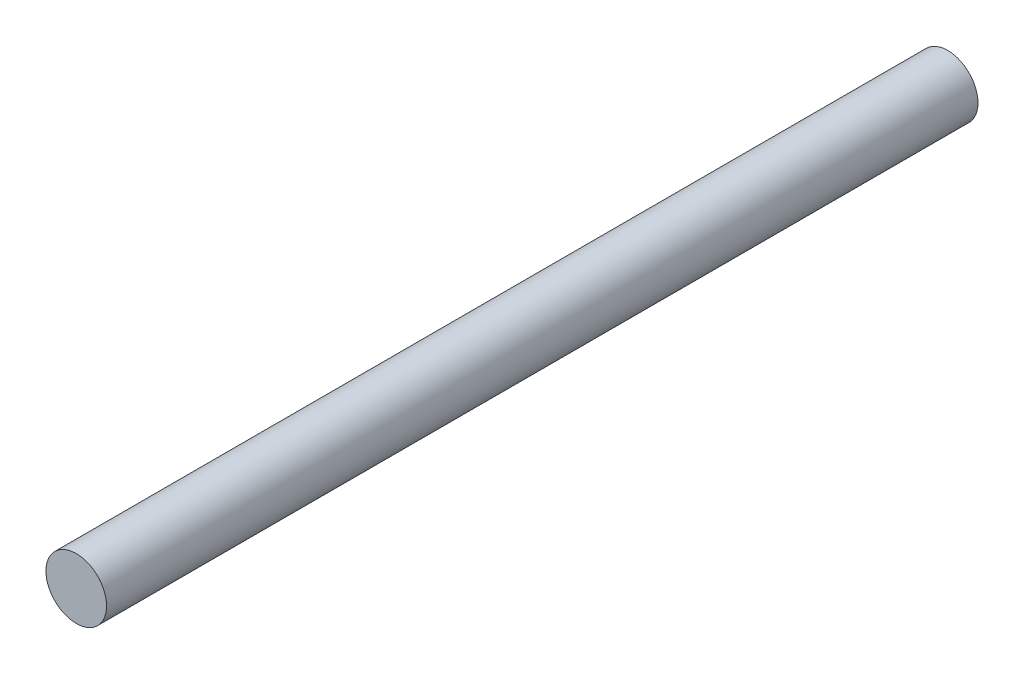
ISO-10303-21;
HEADER;
FILE_DESCRIPTION(('STEP AP214'),'2;1');
FILE_NAME('part.step','',(''),(''),'','','');
FILE_SCHEMA(('AUTOMOTIVE_DESIGN { 1 0 10303 214 1 1 1 1 }'));
ENDSEC;
DATA;
#1=APPLICATION_CONTEXT('core data for automotive mechanical design processes');
#2=APPLICATION_PROTOCOL_DEFINITION('international standard','automotive_design',2000,#1);
#3=PRODUCT_CONTEXT('',#1,'mechanical');
#4=PRODUCT('Part','Part','',(#3));
#5=PRODUCT_RELATED_PRODUCT_CATEGORY('part','',(#4));
#6=PRODUCT_DEFINITION_FORMATION('','',#4);
#7=PRODUCT_DEFINITION_CONTEXT('part definition',#1,'design');
#8=PRODUCT_DEFINITION('design','',#6,#7);
#9=PRODUCT_DEFINITION_SHAPE('','',#8);
#10=(LENGTH_UNIT() NAMED_UNIT(*) SI_UNIT(.MILLI.,.METRE.));
#11=(NAMED_UNIT(*) PLANE_ANGLE_UNIT() SI_UNIT($,.RADIAN.));
#12=(NAMED_UNIT(*) SI_UNIT($,.STERADIAN.) SOLID_ANGLE_UNIT());
#13=UNCERTAINTY_MEASURE_WITH_UNIT(LENGTH_MEASURE(1.E-05),#10,'distance_accuracy_value','');
#14=(GEOMETRIC_REPRESENTATION_CONTEXT(3) GLOBAL_UNCERTAINTY_ASSIGNED_CONTEXT((#13)) GLOBAL_UNIT_ASSIGNED_CONTEXT((#10,
#11,#12)) REPRESENTATION_CONTEXT('',''));
#15=CARTESIAN_POINT('',(0.,0.,0.));
#16=DIRECTION('',(0.,0.,1.));
#17=DIRECTION('',(1.,0.,0.));
#18=AXIS2_PLACEMENT_3D('',#15,#16,#17);
#19=CARTESIAN_POINT('',(0.,0.,180.));
#20=DIRECTION('',(0.,0.,-1.));
#21=DIRECTION('',(-1.,0.,0.));
#22=AXIS2_PLACEMENT_3D('',#19,#20,#21);
#23=CYLINDRICAL_SURFACE('',#22,6.260668565);
#24=CARTESIAN_POINT('',(0.,0.,180.));
#25=DIRECTION('',(0.,0.,1.));
#26=DIRECTION('',(1.,0.,0.));
#27=AXIS2_PLACEMENT_3D('',#24,#25,#26);
#28=CIRCLE('',#27,6.260668565);
#29=CARTESIAN_POINT('',(6.260668565,0.,180.));
#30=VERTEX_POINT('',#29);
#31=EDGE_CURVE('E10',#30,#30,#28,.T.);
#32=ORIENTED_EDGE('',*,*,#31,.F.);
#33=EDGE_LOOP('',(#32));
#34=FACE_BOUND('',#33,.T.);
#35=CARTESIAN_POINT('',(0.,0.,0.));
#36=DIRECTION('',(0.,0.,1.));
#37=DIRECTION('',(1.,0.,0.));
#38=AXIS2_PLACEMENT_3D('',#35,#36,#37);
#39=CIRCLE('',#38,6.260668565);
#40=CARTESIAN_POINT('',(6.260668565,0.,0.));
#41=VERTEX_POINT('',#40);
#42=EDGE_CURVE('E40',#41,#41,#39,.T.);
#43=ORIENTED_EDGE('',*,*,#42,.T.);
#44=EDGE_LOOP('',(#43));
#45=FACE_BOUND('',#44,.T.);
#46=ADVANCED_FACE('F37',(#34,#45),#23,.T.);
#47=CARTESIAN_POINT('',(0.,0.,180.));
#48=DIRECTION('',(0.,0.,1.));
#49=DIRECTION('',(1.,0.,0.));
#50=AXIS2_PLACEMENT_3D('',#47,#48,#49);
#51=PLANE('',#50);
#52=ORIENTED_EDGE('',*,*,#31,.T.);
#53=EDGE_LOOP('',(#52));
#54=FACE_BOUND('',#53,.T.);
#55=ADVANCED_FACE('F54',(#54),#51,.T.);
#56=CARTESIAN_POINT('',(0.,0.,0.));
#57=DIRECTION('',(0.,0.,1.));
#58=DIRECTION('',(1.,0.,0.));
#59=AXIS2_PLACEMENT_3D('',#56,#57,#58);
#60=PLANE('',#59);
#61=ORIENTED_EDGE('',*,*,#42,.F.);
#62=EDGE_LOOP('',(#61));
#63=FACE_BOUND('',#62,.T.);
#64=ADVANCED_FACE('F52',(#63),#60,.F.);
#65=CLOSED_SHELL('',(#46,#55,#64));
#66=MANIFOLD_SOLID_BREP('B2',#65);
#67=ADVANCED_BREP_SHAPE_REPRESENTATION('',(#18,#66),#14);
#68=SHAPE_DEFINITION_REPRESENTATION(#9,#67);
ENDSEC;
END-ISO-10303-21;
